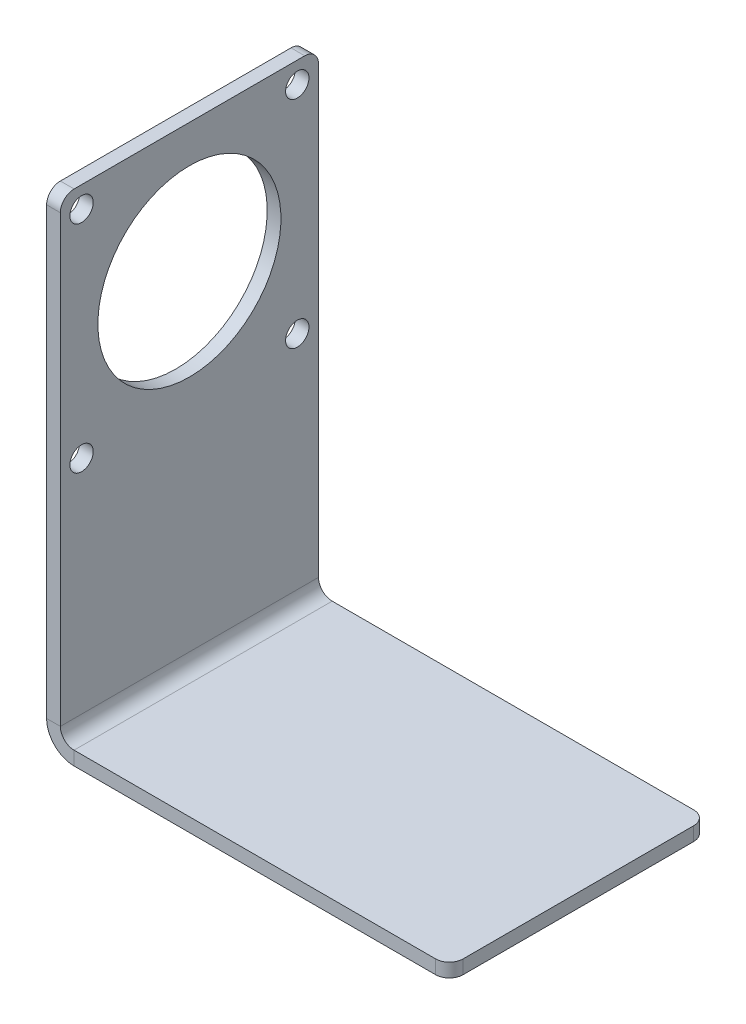
ISO-10303-21;
HEADER;
FILE_DESCRIPTION(('STEP AP214'),'2;1');
FILE_NAME('part.step','',(''),(''),'','','');
FILE_SCHEMA(('AUTOMOTIVE_DESIGN { 1 0 10303 214 1 1 1 1 }'));
ENDSEC;
DATA;
#1=APPLICATION_CONTEXT('core data for automotive mechanical design processes');
#2=APPLICATION_PROTOCOL_DEFINITION('international standard','automotive_design',2000,#1);
#3=PRODUCT_CONTEXT('',#1,'mechanical');
#4=PRODUCT('Part','Part','',(#3));
#5=PRODUCT_RELATED_PRODUCT_CATEGORY('part','',(#4));
#6=PRODUCT_DEFINITION_FORMATION('','',#4);
#7=PRODUCT_DEFINITION_CONTEXT('part definition',#1,'design');
#8=PRODUCT_DEFINITION('design','',#6,#7);
#9=PRODUCT_DEFINITION_SHAPE('','',#8);
#10=(LENGTH_UNIT() NAMED_UNIT(*) SI_UNIT(.MILLI.,.METRE.));
#11=(NAMED_UNIT(*) PLANE_ANGLE_UNIT() SI_UNIT($,.RADIAN.));
#12=(NAMED_UNIT(*) SI_UNIT($,.STERADIAN.) SOLID_ANGLE_UNIT());
#13=UNCERTAINTY_MEASURE_WITH_UNIT(LENGTH_MEASURE(1.E-05),#10,'distance_accuracy_value','');
#14=(GEOMETRIC_REPRESENTATION_CONTEXT(3) GLOBAL_UNCERTAINTY_ASSIGNED_CONTEXT((#13)) GLOBAL_UNIT_ASSIGNED_CONTEXT((#10,
#11,#12)) REPRESENTATION_CONTEXT('',''));
#15=CARTESIAN_POINT('',(0.,0.,0.));
#16=DIRECTION('',(0.,0.,1.));
#17=DIRECTION('',(1.,0.,0.));
#18=AXIS2_PLACEMENT_3D('',#15,#16,#17);
#19=CARTESIAN_POINT('',(3.00000000000001,-103.2,56.4));
#20=DIRECTION('',(0.,0.,1.));
#21=DIRECTION('',(1.,0.,0.));
#22=AXIS2_PLACEMENT_3D('',#19,#20,#21);
#23=PLANE('',#22);
#24=DIRECTION('',(0.,-1.,0.));
#25=VECTOR('',#24,1.);
#26=CARTESIAN_POINT('',(3.00000000000001,-103.2,56.4));
#27=LINE('',#26,#25);
#28=CARTESIAN_POINT('',(3.00000000000001,-103.2,56.4));
#29=VERTEX_POINT('',#28);
#30=CARTESIAN_POINT('',(3.00000000000001,-106.2,56.4));
#31=VERTEX_POINT('',#30);
#32=EDGE_CURVE('E129',#29,#31,#27,.T.);
#33=ORIENTED_EDGE('',*,*,#32,.F.);
#34=CARTESIAN_POINT('',(3.00000000000001,-100.2,56.4));
#35=DIRECTION('',(0.,0.,-1.));
#36=DIRECTION('',(-1.,0.,0.));
#37=AXIS2_PLACEMENT_3D('',#34,#35,#36);
#38=CIRCLE('',#37,3.);
#39=CARTESIAN_POINT('',(0.,-100.2,56.4));
#40=VERTEX_POINT('',#39);
#41=EDGE_CURVE('E133',#40,#29,#38,.F.);
#42=ORIENTED_EDGE('',*,*,#41,.F.);
#43=DIRECTION('',(1.,0.,0.));
#44=VECTOR('',#43,1.);
#45=CARTESIAN_POINT('',(-2.99999999999999,-100.2,56.4));
#46=LINE('',#45,#44);
#47=CARTESIAN_POINT('',(-2.99999999999999,-100.2,56.4));
#48=VERTEX_POINT('',#47);
#49=EDGE_CURVE('E141',#48,#40,#46,.T.);
#50=ORIENTED_EDGE('',*,*,#49,.F.);
#51=CARTESIAN_POINT('',(3.00000000000001,-100.2,56.4));
#52=DIRECTION('',(0.,0.,1.));
#53=DIRECTION('',(1.,0.,0.));
#54=AXIS2_PLACEMENT_3D('',#51,#52,#53);
#55=CIRCLE('',#54,6.);
#56=EDGE_CURVE('E135',#48,#31,#55,.T.);
#57=ORIENTED_EDGE('',*,*,#56,.T.);
#58=EDGE_LOOP('',(#33,#42,#50,#57));
#59=FACE_BOUND('',#58,.T.);
#60=ADVANCED_FACE('F38',(#59),#23,.T.);
#61=CARTESIAN_POINT('',(-2.99999999999999,-100.2,56.4));
#62=DIRECTION('',(0.,0.,1.));
#63=DIRECTION('',(1.,0.,0.));
#64=AXIS2_PLACEMENT_3D('',#61,#62,#63);
#65=PLANE('',#64);
#66=DIRECTION('',(1.,0.,0.));
#67=VECTOR('',#66,1.);
#68=CARTESIAN_POINT('',(0.,-106.2,56.4));
#69=LINE('',#68,#67);
#70=CARTESIAN_POINT('',(82.,-106.2,56.4));
#71=VERTEX_POINT('',#70);
#72=EDGE_CURVE('E163',#31,#71,#69,.T.);
#73=ORIENTED_EDGE('',*,*,#72,.T.);
#74=DIRECTION('',(0.,-1.,0.));
#75=VECTOR('',#74,1.);
#76=CARTESIAN_POINT('',(82.,-100.2,56.4));
#77=LINE('',#76,#75);
#78=CARTESIAN_POINT('',(82.,-103.2,56.4));
#79=VERTEX_POINT('',#78);
#80=EDGE_CURVE('E162',#71,#79,#77,.F.);
#81=ORIENTED_EDGE('',*,*,#80,.T.);
#82=DIRECTION('',(1.,0.,0.));
#83=VECTOR('',#82,1.);
#84=CARTESIAN_POINT('',(0.,-103.2,56.4));
#85=LINE('',#84,#83);
#86=EDGE_CURVE('E150',#29,#79,#85,.T.);
#87=ORIENTED_EDGE('',*,*,#86,.F.);
#88=ORIENTED_EDGE('',*,*,#32,.T.);
#89=EDGE_LOOP('',(#73,#81,#87,#88));
#90=FACE_BOUND('',#89,.T.);
#91=ADVANCED_FACE('F160',(#90),#65,.T.);
#92=CARTESIAN_POINT('',(0.,-100.2,0.));
#93=DIRECTION('',(0.,0.,-1.));
#94=DIRECTION('',(-1.,0.,0.));
#95=AXIS2_PLACEMENT_3D('',#92,#93,#94);
#96=PLANE('',#95);
#97=DIRECTION('',(-1.,0.,0.));
#98=VECTOR('',#97,1.);
#99=CARTESIAN_POINT('',(0.,-100.2,0.));
#100=LINE('',#99,#98);
#101=CARTESIAN_POINT('',(0.,-100.2,0.));
#102=VERTEX_POINT('',#101);
#103=CARTESIAN_POINT('',(-2.99999999999999,-100.2,0.));
#104=VERTEX_POINT('',#103);
#105=EDGE_CURVE('E208',#102,#104,#100,.T.);
#106=ORIENTED_EDGE('',*,*,#105,.F.);
#107=CARTESIAN_POINT('',(3.00000000000001,-100.2,0.));
#108=DIRECTION('',(0.,0.,-1.));
#109=DIRECTION('',(-1.,0.,0.));
#110=AXIS2_PLACEMENT_3D('',#107,#108,#109);
#111=CIRCLE('',#110,3.);
#112=CARTESIAN_POINT('',(3.00000000000001,-103.2,0.));
#113=VERTEX_POINT('',#112);
#114=EDGE_CURVE('E182',#102,#113,#111,.F.);
#115=ORIENTED_EDGE('',*,*,#114,.T.);
#116=DIRECTION('',(0.,1.,0.));
#117=VECTOR('',#116,1.);
#118=CARTESIAN_POINT('',(3.00000000000001,-106.2,0.));
#119=LINE('',#118,#117);
#120=CARTESIAN_POINT('',(3.00000000000001,-106.2,0.));
#121=VERTEX_POINT('',#120);
#122=EDGE_CURVE('E206',#121,#113,#119,.T.);
#123=ORIENTED_EDGE('',*,*,#122,.F.);
#124=CARTESIAN_POINT('',(3.00000000000001,-100.2,0.));
#125=DIRECTION('',(0.,0.,1.));
#126=DIRECTION('',(1.,0.,0.));
#127=AXIS2_PLACEMENT_3D('',#124,#125,#126);
#128=CIRCLE('',#127,6.);
#129=EDGE_CURVE('E188',#104,#121,#128,.T.);
#130=ORIENTED_EDGE('',*,*,#129,.F.);
#131=EDGE_LOOP('',(#106,#115,#123,#130));
#132=FACE_BOUND('',#131,.T.);
#133=ADVANCED_FACE('F332',(#132),#96,.T.);
#134=CARTESIAN_POINT('',(3.00000000000001,-106.2,0.));
#135=DIRECTION('',(0.,0.,-1.));
#136=DIRECTION('',(-1.,0.,0.));
#137=AXIS2_PLACEMENT_3D('',#134,#135,#136);
#138=PLANE('',#137);
#139=DIRECTION('',(0.,-1.,0.));
#140=VECTOR('',#139,1.);
#141=CARTESIAN_POINT('',(-3.,0.,0.));
#142=LINE('',#141,#140);
#143=CARTESIAN_POINT('',(-3.,-3.,0.));
#144=VERTEX_POINT('',#143);
#145=EDGE_CURVE('E186',#144,#104,#142,.T.);
#146=ORIENTED_EDGE('',*,*,#145,.F.);
#147=DIRECTION('',(1.,0.,0.));
#148=VECTOR('',#147,1.);
#149=CARTESIAN_POINT('',(3.,-3.,0.));
#150=LINE('',#149,#148);
#151=CARTESIAN_POINT('',(0.,-3.,0.));
#152=VERTEX_POINT('',#151);
#153=EDGE_CURVE('E11',#144,#152,#150,.T.);
#154=ORIENTED_EDGE('',*,*,#153,.T.);
#155=DIRECTION('',(0.,-1.,0.));
#156=VECTOR('',#155,1.);
#157=CARTESIAN_POINT('',(0.,0.,0.));
#158=LINE('',#157,#156);
#159=EDGE_CURVE('E184',#152,#102,#158,.T.);
#160=ORIENTED_EDGE('',*,*,#159,.T.);
#161=ORIENTED_EDGE('',*,*,#105,.T.);
#162=EDGE_LOOP('',(#146,#154,#160,#161));
#163=FACE_BOUND('',#162,.T.);
#164=ADVANCED_FACE('F434',(#163),#138,.T.);
#165=CARTESIAN_POINT('',(0.,-106.2,56.4));
#166=DIRECTION('',(0.,1.,0.));
#167=DIRECTION('',(0.,0.,1.));
#168=AXIS2_PLACEMENT_3D('',#165,#166,#167);
#169=PLANE('',#168);
#170=DIRECTION('',(1.,0.,0.));
#171=VECTOR('',#170,1.);
#172=CARTESIAN_POINT('',(0.,-106.2,0.));
#173=LINE('',#172,#171);
#174=CARTESIAN_POINT('',(82.,-106.2,0.));
#175=VERTEX_POINT('',#174);
#176=EDGE_CURVE('E177',#121,#175,#173,.T.);
#177=ORIENTED_EDGE('',*,*,#176,.T.);
#178=CARTESIAN_POINT('',(82.,-106.2,3.));
#179=DIRECTION('',(0.,1.,0.));
#180=DIRECTION('',(0.,0.,1.));
#181=AXIS2_PLACEMENT_3D('',#178,#179,#180);
#182=CIRCLE('',#181,3.);
#183=CARTESIAN_POINT('',(85.,-106.2,3.));
#184=VERTEX_POINT('',#183);
#185=EDGE_CURVE('E217',#175,#184,#182,.F.);
#186=ORIENTED_EDGE('',*,*,#185,.T.);
#187=DIRECTION('',(0.,0.,-1.));
#188=VECTOR('',#187,1.);
#189=CARTESIAN_POINT('',(85.,-106.2,56.4));
#190=LINE('',#189,#188);
#191=CARTESIAN_POINT('',(85.,-106.2,53.4));
#192=VERTEX_POINT('',#191);
#193=EDGE_CURVE('E203',#192,#184,#190,.T.);
#194=ORIENTED_EDGE('',*,*,#193,.F.);
#195=CARTESIAN_POINT('',(82.,-106.2,53.4));
#196=DIRECTION('',(0.,1.,0.));
#197=DIRECTION('',(0.,0.,1.));
#198=AXIS2_PLACEMENT_3D('',#195,#196,#197);
#199=CIRCLE('',#198,3.);
#200=EDGE_CURVE('E215',#192,#71,#199,.F.);
#201=ORIENTED_EDGE('',*,*,#200,.T.);
#202=ORIENTED_EDGE('',*,*,#72,.F.);
#203=DIRECTION('',(0.,0.,-1.));
#204=VECTOR('',#203,1.);
#205=CARTESIAN_POINT('',(3.00000000000001,-106.2,56.4));
#206=LINE('',#205,#204);
#207=EDGE_CURVE('E176',#31,#121,#206,.T.);
#208=ORIENTED_EDGE('',*,*,#207,.T.);
#209=EDGE_LOOP('',(#177,#186,#194,#201,#202,#208));
#210=FACE_BOUND('',#209,.T.);
#211=ADVANCED_FACE('F259',(#210),#169,.F.);
#212=CARTESIAN_POINT('',(85.,-103.2,56.4));
#213=DIRECTION('',(1.,0.,0.));
#214=DIRECTION('',(0.,0.,-1.));
#215=AXIS2_PLACEMENT_3D('',#212,#213,#214);
#216=PLANE('',#215);
#217=ORIENTED_EDGE('',*,*,#193,.T.);
#218=DIRECTION('',(0.,-1.,0.));
#219=VECTOR('',#218,1.);
#220=CARTESIAN_POINT('',(85.,-103.2,3.));
#221=LINE('',#220,#219);
#222=CARTESIAN_POINT('',(85.,-103.2,3.));
#223=VERTEX_POINT('',#222);
#224=EDGE_CURVE('E222',#184,#223,#221,.F.);
#225=ORIENTED_EDGE('',*,*,#224,.T.);
#226=DIRECTION('',(0.,0.,-1.));
#227=VECTOR('',#226,1.);
#228=CARTESIAN_POINT('',(85.,-103.2,56.4));
#229=LINE('',#228,#227);
#230=CARTESIAN_POINT('',(85.,-103.2,53.4));
#231=VERTEX_POINT('',#230);
#232=EDGE_CURVE('E157',#231,#223,#229,.T.);
#233=ORIENTED_EDGE('',*,*,#232,.F.);
#234=DIRECTION('',(0.,-1.,0.));
#235=VECTOR('',#234,1.);
#236=CARTESIAN_POINT('',(85.,-103.2,53.4));
#237=LINE('',#236,#235);
#238=EDGE_CURVE('E219',#231,#192,#237,.T.);
#239=ORIENTED_EDGE('',*,*,#238,.T.);
#240=EDGE_LOOP('',(#217,#225,#233,#239));
#241=FACE_BOUND('',#240,.T.);
#242=ADVANCED_FACE('F481',(#241),#216,.T.);
#243=CARTESIAN_POINT('',(0.,-103.2,56.4));
#244=DIRECTION('',(0.,1.,0.));
#245=DIRECTION('',(0.,0.,1.));
#246=AXIS2_PLACEMENT_3D('',#243,#244,#245);
#247=PLANE('',#246);
#248=ORIENTED_EDGE('',*,*,#232,.T.);
#249=CARTESIAN_POINT('',(82.,-103.2,3.));
#250=DIRECTION('',(0.,1.,0.));
#251=DIRECTION('',(0.,0.,1.));
#252=AXIS2_PLACEMENT_3D('',#249,#250,#251);
#253=CIRCLE('',#252,3.);
#254=CARTESIAN_POINT('',(82.,-103.2,0.));
#255=VERTEX_POINT('',#254);
#256=EDGE_CURVE('E226',#223,#255,#253,.T.);
#257=ORIENTED_EDGE('',*,*,#256,.T.);
#258=DIRECTION('',(1.,0.,0.));
#259=VECTOR('',#258,1.);
#260=CARTESIAN_POINT('',(0.,-103.2,0.));
#261=LINE('',#260,#259);
#262=EDGE_CURVE('E153',#113,#255,#261,.T.);
#263=ORIENTED_EDGE('',*,*,#262,.F.);
#264=DIRECTION('',(0.,0.,-1.));
#265=VECTOR('',#264,1.);
#266=CARTESIAN_POINT('',(3.00000000000001,-103.2,56.4));
#267=LINE('',#266,#265);
#268=EDGE_CURVE('E147',#29,#113,#267,.T.);
#269=ORIENTED_EDGE('',*,*,#268,.F.);
#270=ORIENTED_EDGE('',*,*,#86,.T.);
#271=CARTESIAN_POINT('',(82.,-103.2,53.4));
#272=DIRECTION('',(0.,1.,0.));
#273=DIRECTION('',(0.,0.,1.));
#274=AXIS2_PLACEMENT_3D('',#271,#272,#273);
#275=CIRCLE('',#274,3.);
#276=EDGE_CURVE('E224',#79,#231,#275,.T.);
#277=ORIENTED_EDGE('',*,*,#276,.T.);
#278=EDGE_LOOP('',(#248,#257,#263,#269,#270,#277));
#279=FACE_BOUND('',#278,.T.);
#280=ADVANCED_FACE('F149',(#279),#247,.T.);
#281=CARTESIAN_POINT('',(3.00000000000001,-100.2,56.4));
#282=DIRECTION('',(0.,0.,-1.));
#283=DIRECTION('',(-1.,0.,0.));
#284=AXIS2_PLACEMENT_3D('',#281,#282,#283);
#285=CYLINDRICAL_SURFACE('',#284,3.);
#286=ORIENTED_EDGE('',*,*,#114,.F.);
#287=DIRECTION('',(0.,0.,-1.));
#288=VECTOR('',#287,1.);
#289=CARTESIAN_POINT('',(0.,-100.2,56.4));
#290=LINE('',#289,#288);
#291=EDGE_CURVE('E158',#40,#102,#290,.T.);
#292=ORIENTED_EDGE('',*,*,#291,.F.);
#293=ORIENTED_EDGE('',*,*,#41,.T.);
#294=ORIENTED_EDGE('',*,*,#268,.T.);
#295=EDGE_LOOP('',(#286,#292,#293,#294));
#296=FACE_BOUND('',#295,.T.);
#297=ADVANCED_FACE('F166',(#296),#285,.F.);
#298=CARTESIAN_POINT('',(0.,0.,56.4));
#299=DIRECTION('',(1.,0.,0.));
#300=DIRECTION('',(0.,1.,0.));
#301=AXIS2_PLACEMENT_3D('',#298,#299,#300);
#302=PLANE('',#301);
#303=CARTESIAN_POINT('',(0.,-4.63,51.7699999999998));
#304=DIRECTION('',(1.,0.,0.));
#305=DIRECTION('',(0.,1.,0.));
#306=AXIS2_PLACEMENT_3D('',#303,#304,#305);
#307=CIRCLE('',#306,2.55000000000001);
#308=CARTESIAN_POINT('',(0.,-2.08,51.7699999999998));
#309=VERTEX_POINT('',#308);
#310=EDGE_CURVE('E286',#309,#309,#307,.T.);
#311=ORIENTED_EDGE('',*,*,#310,.F.);
#312=EDGE_LOOP('',(#311));
#313=FACE_BOUND('',#312,.T.);
#314=CARTESIAN_POINT('',(0.,-4.63000000000025,4.63));
#315=DIRECTION('',(1.,0.,0.));
#316=DIRECTION('',(0.,1.,0.));
#317=AXIS2_PLACEMENT_3D('',#314,#315,#316);
#318=CIRCLE('',#317,2.55);
#319=CARTESIAN_POINT('',(0.,-2.08000000000026,4.63));
#320=VERTEX_POINT('',#319);
#321=EDGE_CURVE('E280',#320,#320,#318,.T.);
#322=ORIENTED_EDGE('',*,*,#321,.F.);
#323=EDGE_LOOP('',(#322));
#324=FACE_BOUND('',#323,.T.);
#325=CARTESIAN_POINT('',(0.,-51.77,4.63000000000025));
#326=DIRECTION('',(1.,0.,0.));
#327=DIRECTION('',(0.,1.,0.));
#328=AXIS2_PLACEMENT_3D('',#325,#326,#327);
#329=CIRCLE('',#328,2.55);
#330=CARTESIAN_POINT('',(0.,-49.22,4.63000000000025));
#331=VERTEX_POINT('',#330);
#332=EDGE_CURVE('E274',#331,#331,#329,.T.);
#333=ORIENTED_EDGE('',*,*,#332,.F.);
#334=EDGE_LOOP('',(#333));
#335=FACE_BOUND('',#334,.T.);
#336=CARTESIAN_POINT('',(0.,-51.7699999999998,51.77));
#337=DIRECTION('',(1.,0.,0.));
#338=DIRECTION('',(0.,1.,0.));
#339=AXIS2_PLACEMENT_3D('',#336,#337,#338);
#340=CIRCLE('',#339,2.55);
#341=CARTESIAN_POINT('',(0.,-49.2199999999998,51.77));
#342=VERTEX_POINT('',#341);
#343=EDGE_CURVE('E268',#342,#342,#340,.T.);
#344=ORIENTED_EDGE('',*,*,#343,.F.);
#345=EDGE_LOOP('',(#344));
#346=FACE_BOUND('',#345,.T.);
#347=CARTESIAN_POINT('',(0.,-28.2,28.2));
#348=DIRECTION('',(1.,0.,0.));
#349=DIRECTION('',(0.,1.,0.));
#350=AXIS2_PLACEMENT_3D('',#347,#348,#349);
#351=CIRCLE('',#350,20.);
#352=CARTESIAN_POINT('',(0.,-8.2,28.2));
#353=VERTEX_POINT('',#352);
#354=EDGE_CURVE('E262',#353,#353,#351,.T.);
#355=ORIENTED_EDGE('',*,*,#354,.F.);
#356=EDGE_LOOP('',(#355));
#357=FACE_BOUND('',#356,.T.);
#358=DIRECTION('',(0.,0.,-1.));
#359=VECTOR('',#358,1.);
#360=CARTESIAN_POINT('',(0.,0.,56.4));
#361=LINE('',#360,#359);
#362=CARTESIAN_POINT('',(0.,0.,53.4));
#363=VERTEX_POINT('',#362);
#364=CARTESIAN_POINT('',(0.,0.,3.));
#365=VERTEX_POINT('',#364);
#366=EDGE_CURVE('E198',#363,#365,#361,.T.);
#367=ORIENTED_EDGE('',*,*,#366,.F.);
#368=CARTESIAN_POINT('',(0.,-3.,53.4));
#369=DIRECTION('',(1.,0.,0.));
#370=DIRECTION('',(0.,1.,0.));
#371=AXIS2_PLACEMENT_3D('',#368,#369,#370);
#372=CIRCLE('',#371,3.);
#373=CARTESIAN_POINT('',(0.,-3.,56.4));
#374=VERTEX_POINT('',#373);
#375=EDGE_CURVE('E236',#363,#374,#372,.T.);
#376=ORIENTED_EDGE('',*,*,#375,.T.);
#377=DIRECTION('',(0.,-1.,0.));
#378=VECTOR('',#377,1.);
#379=CARTESIAN_POINT('',(0.,0.,56.4));
#380=LINE('',#379,#378);
#381=EDGE_CURVE('E168',#374,#40,#380,.T.);
#382=ORIENTED_EDGE('',*,*,#381,.T.);
#383=ORIENTED_EDGE('',*,*,#291,.T.);
#384=ORIENTED_EDGE('',*,*,#159,.F.);
#385=CARTESIAN_POINT('',(0.,-3.,3.));
#386=DIRECTION('',(1.,0.,0.));
#387=DIRECTION('',(0.,1.,0.));
#388=AXIS2_PLACEMENT_3D('',#385,#386,#387);
#389=CIRCLE('',#388,3.);
#390=EDGE_CURVE('E234',#152,#365,#389,.T.);
#391=ORIENTED_EDGE('',*,*,#390,.T.);
#392=EDGE_LOOP('',(#367,#376,#382,#383,#384,#391));
#393=FACE_BOUND('',#392,.T.);
#394=ADVANCED_FACE('F251',(#313,#324,#335,#346,#357,#393),#302,.T.);
#395=CARTESIAN_POINT('',(-3.,0.,56.4));
#396=DIRECTION('',(0.,1.,0.));
#397=DIRECTION('',(-1.,0.,0.));
#398=AXIS2_PLACEMENT_3D('',#395,#396,#397);
#399=PLANE('',#398);
#400=DIRECTION('',(0.,0.,-1.));
#401=VECTOR('',#400,1.);
#402=CARTESIAN_POINT('',(-3.,0.,56.4));
#403=LINE('',#402,#401);
#404=CARTESIAN_POINT('',(-3.,0.,53.4));
#405=VERTEX_POINT('',#404);
#406=CARTESIAN_POINT('',(-3.,0.,3.));
#407=VERTEX_POINT('',#406);
#408=EDGE_CURVE('E196',#405,#407,#403,.T.);
#409=ORIENTED_EDGE('',*,*,#408,.F.);
#410=DIRECTION('',(1.,0.,0.));
#411=VECTOR('',#410,1.);
#412=CARTESIAN_POINT('',(0.,0.,53.4));
#413=LINE('',#412,#411);
#414=EDGE_CURVE('E231',#405,#363,#413,.T.);
#415=ORIENTED_EDGE('',*,*,#414,.T.);
#416=ORIENTED_EDGE('',*,*,#366,.T.);
#417=DIRECTION('',(1.,0.,0.));
#418=VECTOR('',#417,1.);
#419=CARTESIAN_POINT('',(-3.,0.,3.));
#420=LINE('',#419,#418);
#421=EDGE_CURVE('E229',#365,#407,#420,.F.);
#422=ORIENTED_EDGE('',*,*,#421,.T.);
#423=EDGE_LOOP('',(#409,#415,#416,#422));
#424=FACE_BOUND('',#423,.T.);
#425=ADVANCED_FACE('F246',(#424),#399,.T.);
#426=CARTESIAN_POINT('',(-3.,0.,56.4));
#427=DIRECTION('',(1.,0.,0.));
#428=DIRECTION('',(0.,1.,0.));
#429=AXIS2_PLACEMENT_3D('',#426,#427,#428);
#430=PLANE('',#429);
#431=CARTESIAN_POINT('',(-3.00000000000001,-4.63,51.7699999999998));
#432=DIRECTION('',(1.,0.,0.));
#433=DIRECTION('',(0.,1.,0.));
#434=AXIS2_PLACEMENT_3D('',#431,#432,#433);
#435=CIRCLE('',#434,2.55000000000001);
#436=CARTESIAN_POINT('',(-3.00000000000001,-2.08,51.7699999999998));
#437=VERTEX_POINT('',#436);
#438=EDGE_CURVE('E265',#437,#437,#435,.T.);
#439=ORIENTED_EDGE('',*,*,#438,.T.);
#440=EDGE_LOOP('',(#439));
#441=FACE_BOUND('',#440,.T.);
#442=CARTESIAN_POINT('',(-3.00000000000001,-4.63000000000025,4.63));
#443=DIRECTION('',(1.,0.,0.));
#444=DIRECTION('',(0.,1.,0.));
#445=AXIS2_PLACEMENT_3D('',#442,#443,#444);
#446=CIRCLE('',#445,2.55);
#447=CARTESIAN_POINT('',(-3.00000000000001,-2.08000000000026,4.63));
#448=VERTEX_POINT('',#447);
#449=EDGE_CURVE('E283',#448,#448,#446,.T.);
#450=ORIENTED_EDGE('',*,*,#449,.T.);
#451=EDGE_LOOP('',(#450));
#452=FACE_BOUND('',#451,.T.);
#453=CARTESIAN_POINT('',(-3.00000000000001,-51.77,4.63000000000025));
#454=DIRECTION('',(1.,0.,0.));
#455=DIRECTION('',(0.,1.,0.));
#456=AXIS2_PLACEMENT_3D('',#453,#454,#455);
#457=CIRCLE('',#456,2.55);
#458=CARTESIAN_POINT('',(-3.00000000000001,-49.22,4.63000000000025));
#459=VERTEX_POINT('',#458);
#460=EDGE_CURVE('E277',#459,#459,#457,.T.);
#461=ORIENTED_EDGE('',*,*,#460,.T.);
#462=EDGE_LOOP('',(#461));
#463=FACE_BOUND('',#462,.T.);
#464=CARTESIAN_POINT('',(-3.00000000000001,-51.7699999999998,51.77));
#465=DIRECTION('',(1.,0.,0.));
#466=DIRECTION('',(0.,1.,0.));
#467=AXIS2_PLACEMENT_3D('',#464,#465,#466);
#468=CIRCLE('',#467,2.55);
#469=CARTESIAN_POINT('',(-3.00000000000001,-49.2199999999998,51.77));
#470=VERTEX_POINT('',#469);
#471=EDGE_CURVE('E271',#470,#470,#468,.T.);
#472=ORIENTED_EDGE('',*,*,#471,.T.);
#473=EDGE_LOOP('',(#472));
#474=FACE_BOUND('',#473,.T.);
#475=CARTESIAN_POINT('',(-3.00000000000001,-28.2,28.2));
#476=DIRECTION('',(1.,0.,0.));
#477=DIRECTION('',(0.,1.,0.));
#478=AXIS2_PLACEMENT_3D('',#475,#476,#477);
#479=CIRCLE('',#478,20.);
#480=CARTESIAN_POINT('',(-3.00000000000001,-8.2,28.2));
#481=VERTEX_POINT('',#480);
#482=EDGE_CURVE('E180',#481,#481,#479,.T.);
#483=ORIENTED_EDGE('',*,*,#482,.T.);
#484=EDGE_LOOP('',(#483));
#485=FACE_BOUND('',#484,.T.);
#486=DIRECTION('',(0.,-1.,0.));
#487=VECTOR('',#486,1.);
#488=CARTESIAN_POINT('',(-3.,0.,56.4));
#489=LINE('',#488,#487);
#490=CARTESIAN_POINT('',(-3.,-3.,56.4));
#491=VERTEX_POINT('',#490);
#492=EDGE_CURVE('E170',#491,#48,#489,.T.);
#493=ORIENTED_EDGE('',*,*,#492,.F.);
#494=CARTESIAN_POINT('',(-3.,-3.,53.4));
#495=DIRECTION('',(1.,0.,0.));
#496=DIRECTION('',(0.,1.,0.));
#497=AXIS2_PLACEMENT_3D('',#494,#495,#496);
#498=CIRCLE('',#497,3.);
#499=EDGE_CURVE('E46',#491,#405,#498,.F.);
#500=ORIENTED_EDGE('',*,*,#499,.T.);
#501=ORIENTED_EDGE('',*,*,#408,.T.);
#502=CARTESIAN_POINT('',(-3.,-3.,3.));
#503=DIRECTION('',(1.,0.,0.));
#504=DIRECTION('',(0.,1.,0.));
#505=AXIS2_PLACEMENT_3D('',#502,#503,#504);
#506=CIRCLE('',#505,3.);
#507=EDGE_CURVE('E53',#407,#144,#506,.F.);
#508=ORIENTED_EDGE('',*,*,#507,.T.);
#509=ORIENTED_EDGE('',*,*,#145,.T.);
#510=DIRECTION('',(0.,0.,-1.));
#511=VECTOR('',#510,1.);
#512=CARTESIAN_POINT('',(-2.99999999999999,-100.2,56.4));
#513=LINE('',#512,#511);
#514=EDGE_CURVE('E193',#48,#104,#513,.T.);
#515=ORIENTED_EDGE('',*,*,#514,.F.);
#516=EDGE_LOOP('',(#493,#500,#501,#508,#509,#515));
#517=FACE_BOUND('',#516,.T.);
#518=ADVANCED_FACE('F241',(#441,#452,#463,#474,#485,#517),#430,.F.);
#519=CARTESIAN_POINT('',(3.00000000000001,-100.2,56.4));
#520=DIRECTION('',(0.,0.,-1.));
#521=DIRECTION('',(-1.,0.,0.));
#522=AXIS2_PLACEMENT_3D('',#519,#520,#521);
#523=CYLINDRICAL_SURFACE('',#522,6.);
#524=ORIENTED_EDGE('',*,*,#129,.T.);
#525=ORIENTED_EDGE('',*,*,#207,.F.);
#526=ORIENTED_EDGE('',*,*,#56,.F.);
#527=ORIENTED_EDGE('',*,*,#514,.T.);
#528=EDGE_LOOP('',(#524,#525,#526,#527));
#529=FACE_BOUND('',#528,.T.);
#530=ADVANCED_FACE('F255',(#529),#523,.T.);
#531=CARTESIAN_POINT('',(3.00000000000001,-100.2,56.4));
#532=DIRECTION('',(0.,0.,-1.));
#533=DIRECTION('',(-1.,0.,0.));
#534=AXIS2_PLACEMENT_3D('',#531,#532,#533);
#535=PLANE('',#534);
#536=ORIENTED_EDGE('',*,*,#381,.F.);
#537=DIRECTION('',(1.,0.,0.));
#538=VECTOR('',#537,1.);
#539=CARTESIAN_POINT('',(-3.,-3.,56.4));
#540=LINE('',#539,#538);
#541=EDGE_CURVE('E61',#374,#491,#540,.F.);
#542=ORIENTED_EDGE('',*,*,#541,.T.);
#543=ORIENTED_EDGE('',*,*,#492,.T.);
#544=ORIENTED_EDGE('',*,*,#49,.T.);
#545=EDGE_LOOP('',(#536,#542,#543,#544));
#546=FACE_BOUND('',#545,.T.);
#547=ADVANCED_FACE('F252',(#546),#535,.F.);
#548=CARTESIAN_POINT('',(3.00000000000001,-100.2,0.));
#549=DIRECTION('',(0.,0.,-1.));
#550=DIRECTION('',(-1.,0.,0.));
#551=AXIS2_PLACEMENT_3D('',#548,#549,#550);
#552=PLANE('',#551);
#553=ORIENTED_EDGE('',*,*,#262,.T.);
#554=DIRECTION('',(0.,-1.,0.));
#555=VECTOR('',#554,1.);
#556=CARTESIAN_POINT('',(82.,-100.2,0.));
#557=LINE('',#556,#555);
#558=EDGE_CURVE('E140',#255,#175,#557,.T.);
#559=ORIENTED_EDGE('',*,*,#558,.T.);
#560=ORIENTED_EDGE('',*,*,#176,.F.);
#561=ORIENTED_EDGE('',*,*,#122,.T.);
#562=EDGE_LOOP('',(#553,#559,#560,#561));
#563=FACE_BOUND('',#562,.T.);
#564=ADVANCED_FACE('F340',(#563),#552,.T.);
#565=CARTESIAN_POINT('',(82.,-100.2,3.));
#566=DIRECTION('',(0.,-1.,0.));
#567=DIRECTION('',(0.,0.,-1.));
#568=AXIS2_PLACEMENT_3D('',#565,#566,#567);
#569=CYLINDRICAL_SURFACE('',#568,3.);
#570=ORIENTED_EDGE('',*,*,#256,.F.);
#571=ORIENTED_EDGE('',*,*,#224,.F.);
#572=ORIENTED_EDGE('',*,*,#185,.F.);
#573=ORIENTED_EDGE('',*,*,#558,.F.);
#574=EDGE_LOOP('',(#570,#571,#572,#573));
#575=FACE_BOUND('',#574,.T.);
#576=ADVANCED_FACE('F336',(#575),#569,.T.);
#577=CARTESIAN_POINT('',(82.,-103.2,53.4));
#578=DIRECTION('',(0.,-1.,0.));
#579=DIRECTION('',(0.,0.,-1.));
#580=AXIS2_PLACEMENT_3D('',#577,#578,#579);
#581=CYLINDRICAL_SURFACE('',#580,3.);
#582=ORIENTED_EDGE('',*,*,#276,.F.);
#583=ORIENTED_EDGE('',*,*,#80,.F.);
#584=ORIENTED_EDGE('',*,*,#200,.F.);
#585=ORIENTED_EDGE('',*,*,#238,.F.);
#586=EDGE_LOOP('',(#582,#583,#584,#585));
#587=FACE_BOUND('',#586,.T.);
#588=ADVANCED_FACE('F339',(#587),#581,.T.);
#589=CARTESIAN_POINT('',(-3.,-3.,53.4));
#590=DIRECTION('',(-1.,0.,0.));
#591=DIRECTION('',(0.,-1.,0.));
#592=AXIS2_PLACEMENT_3D('',#589,#590,#591);
#593=CYLINDRICAL_SURFACE('',#592,3.);
#594=ORIENTED_EDGE('',*,*,#499,.F.);
#595=ORIENTED_EDGE('',*,*,#541,.F.);
#596=ORIENTED_EDGE('',*,*,#375,.F.);
#597=ORIENTED_EDGE('',*,*,#414,.F.);
#598=EDGE_LOOP('',(#594,#595,#596,#597));
#599=FACE_BOUND('',#598,.T.);
#600=ADVANCED_FACE('F249',(#599),#593,.T.);
#601=CARTESIAN_POINT('',(3.,-3.,3.));
#602=DIRECTION('',(1.,0.,0.));
#603=DIRECTION('',(0.,1.,0.));
#604=AXIS2_PLACEMENT_3D('',#601,#602,#603);
#605=CYLINDRICAL_SURFACE('',#604,3.);
#606=ORIENTED_EDGE('',*,*,#507,.F.);
#607=ORIENTED_EDGE('',*,*,#421,.F.);
#608=ORIENTED_EDGE('',*,*,#390,.F.);
#609=ORIENTED_EDGE('',*,*,#153,.F.);
#610=EDGE_LOOP('',(#606,#607,#608,#609));
#611=FACE_BOUND('',#610,.T.);
#612=ADVANCED_FACE('F40',(#611),#605,.T.);
#613=CARTESIAN_POINT('',(-3.00000000000001,-28.2,28.2));
#614=DIRECTION('',(1.,0.,0.));
#615=DIRECTION('',(0.,1.,0.));
#616=AXIS2_PLACEMENT_3D('',#613,#614,#615);
#617=CYLINDRICAL_SURFACE('',#616,20.);
#618=ORIENTED_EDGE('',*,*,#482,.F.);
#619=EDGE_LOOP('',(#618));
#620=FACE_BOUND('',#619,.T.);
#621=ORIENTED_EDGE('',*,*,#354,.T.);
#622=EDGE_LOOP('',(#621));
#623=FACE_BOUND('',#622,.T.);
#624=ADVANCED_FACE('F312',(#620,#623),#617,.F.);
#625=CARTESIAN_POINT('',(-3.00000000000001,-51.7699999999998,51.77));
#626=DIRECTION('',(1.,0.,0.));
#627=DIRECTION('',(0.,1.,0.));
#628=AXIS2_PLACEMENT_3D('',#625,#626,#627);
#629=CYLINDRICAL_SURFACE('',#628,2.55);
#630=ORIENTED_EDGE('',*,*,#471,.F.);
#631=EDGE_LOOP('',(#630));
#632=FACE_BOUND('',#631,.T.);
#633=ORIENTED_EDGE('',*,*,#343,.T.);
#634=EDGE_LOOP('',(#633));
#635=FACE_BOUND('',#634,.T.);
#636=ADVANCED_FACE('F314',(#632,#635),#629,.F.);
#637=CARTESIAN_POINT('',(-3.00000000000001,-51.77,4.63000000000025));
#638=DIRECTION('',(1.,0.,0.));
#639=DIRECTION('',(0.,1.,0.));
#640=AXIS2_PLACEMENT_3D('',#637,#638,#639);
#641=CYLINDRICAL_SURFACE('',#640,2.55);
#642=ORIENTED_EDGE('',*,*,#460,.F.);
#643=EDGE_LOOP('',(#642));
#644=FACE_BOUND('',#643,.T.);
#645=ORIENTED_EDGE('',*,*,#332,.T.);
#646=EDGE_LOOP('',(#645));
#647=FACE_BOUND('',#646,.T.);
#648=ADVANCED_FACE('F321',(#644,#647),#641,.F.);
#649=CARTESIAN_POINT('',(-3.00000000000001,-4.63000000000025,4.63));
#650=DIRECTION('',(1.,0.,0.));
#651=DIRECTION('',(0.,1.,0.));
#652=AXIS2_PLACEMENT_3D('',#649,#650,#651);
#653=CYLINDRICAL_SURFACE('',#652,2.55);
#654=ORIENTED_EDGE('',*,*,#449,.F.);
#655=EDGE_LOOP('',(#654));
#656=FACE_BOUND('',#655,.T.);
#657=ORIENTED_EDGE('',*,*,#321,.T.);
#658=EDGE_LOOP('',(#657));
#659=FACE_BOUND('',#658,.T.);
#660=ADVANCED_FACE('F297',(#656,#659),#653,.F.);
#661=CARTESIAN_POINT('',(-3.00000000000001,-4.63,51.7699999999998));
#662=DIRECTION('',(1.,0.,0.));
#663=DIRECTION('',(0.,1.,0.));
#664=AXIS2_PLACEMENT_3D('',#661,#662,#663);
#665=CYLINDRICAL_SURFACE('',#664,2.55000000000001);
#666=ORIENTED_EDGE('',*,*,#438,.F.);
#667=EDGE_LOOP('',(#666));
#668=FACE_BOUND('',#667,.T.);
#669=ORIENTED_EDGE('',*,*,#310,.T.);
#670=EDGE_LOOP('',(#669));
#671=FACE_BOUND('',#670,.T.);
#672=ADVANCED_FACE('F294',(#668,#671),#665,.F.);
#673=CLOSED_SHELL('',(#60,#91,#133,#164,#211,#242,#280,#297,#394,#425,#518,#530,#547,#564,#576,
#588,#600,#612,#624,#636,#648,#660,#672));
#674=MANIFOLD_SOLID_BREP('B2',#673);
#675=ADVANCED_BREP_SHAPE_REPRESENTATION('',(#18,#674),#14);
#676=SHAPE_DEFINITION_REPRESENTATION(#9,#675);
ENDSEC;
END-ISO-10303-21;
